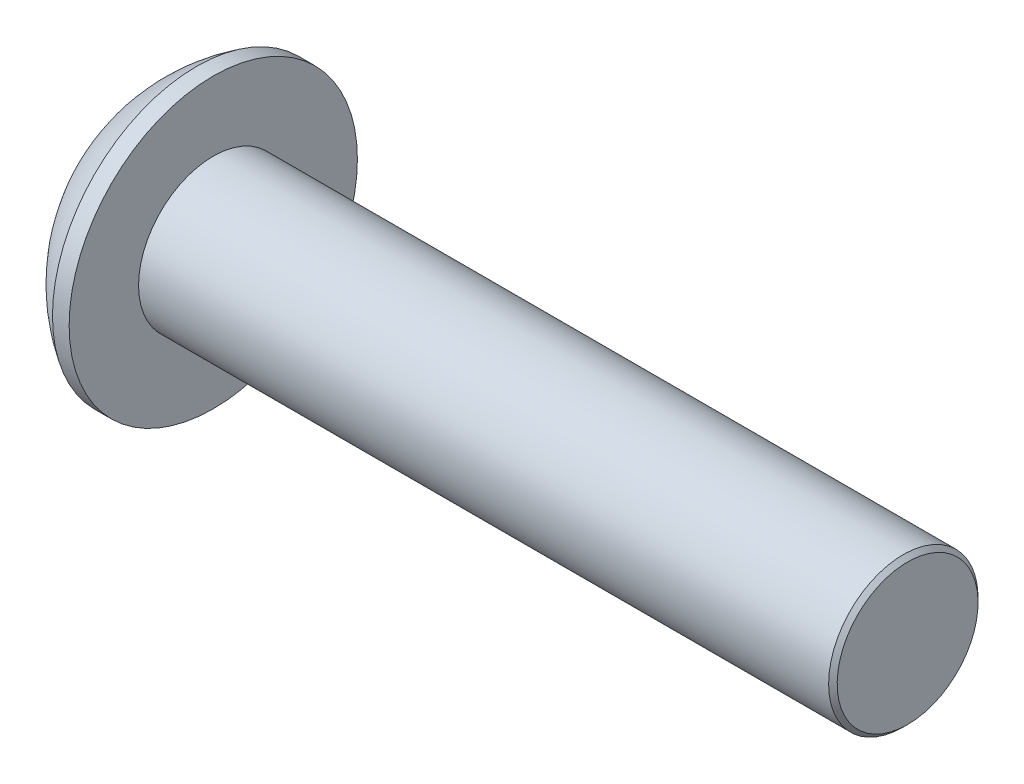
ISO-10303-21;
HEADER;
FILE_DESCRIPTION(('STEP AP214'),'2;1');
FILE_NAME('part.step','',(''),(''),'','','');
FILE_SCHEMA(('AUTOMOTIVE_DESIGN { 1 0 10303 214 1 1 1 1 }'));
ENDSEC;
DATA;
#1=APPLICATION_CONTEXT('core data for automotive mechanical design processes');
#2=APPLICATION_PROTOCOL_DEFINITION('international standard','automotive_design',2000,#1);
#3=PRODUCT_CONTEXT('',#1,'mechanical');
#4=PRODUCT('Part','Part','',(#3));
#5=PRODUCT_RELATED_PRODUCT_CATEGORY('part','',(#4));
#6=PRODUCT_DEFINITION_FORMATION('','',#4);
#7=PRODUCT_DEFINITION_CONTEXT('part definition',#1,'design');
#8=PRODUCT_DEFINITION('design','',#6,#7);
#9=PRODUCT_DEFINITION_SHAPE('','',#8);
#10=(LENGTH_UNIT() NAMED_UNIT(*) SI_UNIT(.MILLI.,.METRE.));
#11=(NAMED_UNIT(*) PLANE_ANGLE_UNIT() SI_UNIT($,.RADIAN.));
#12=(NAMED_UNIT(*) SI_UNIT($,.STERADIAN.) SOLID_ANGLE_UNIT());
#13=UNCERTAINTY_MEASURE_WITH_UNIT(LENGTH_MEASURE(1.E-05),#10,'distance_accuracy_value','');
#14=(GEOMETRIC_REPRESENTATION_CONTEXT(3) GLOBAL_UNCERTAINTY_ASSIGNED_CONTEXT((#13)) GLOBAL_UNIT_ASSIGNED_CONTEXT((#10,
#11,#12)) REPRESENTATION_CONTEXT('',''));
#15=CARTESIAN_POINT('',(0.,0.,0.));
#16=DIRECTION('',(0.,0.,1.));
#17=DIRECTION('',(1.,0.,0.));
#18=AXIS2_PLACEMENT_3D('',#15,#16,#17);
#19=CARTESIAN_POINT('',(1.32080207114083,0.,0.));
#20=DIRECTION('',(-1.,0.,0.));
#21=DIRECTION('',(0.,0.,1.));
#22=AXIS2_PLACEMENT_3D('',#19,#20,#21);
#23=CONICAL_SURFACE('',#22,1.19380119577328,1.0471975499995);
#24=CARTESIAN_POINT('',(2.01004351478429,0.,-4.44089209850063E-13));
#25=VERTEX_POINT('',#24);
#26=VERTEX_LOOP('',#25);
#27=FACE_BOUND('',#26,.T.);
#28=CARTESIAN_POINT('',(1.3208,0.,0.));
#29=DIRECTION('',(1.,0.,0.));
#30=DIRECTION('',(0.,0.,-1.));
#31=AXIS2_PLACEMENT_3D('',#28,#29,#30);
#32=CIRCLE('',#31,1.19380478309441);
#33=CARTESIAN_POINT('',(1.3208,1.0338631981785,0.596901195773596));
#34=VERTEX_POINT('',#33);
#35=CARTESIAN_POINT('',(1.3208,1.0338631981785,-0.5969011957736));
#36=VERTEX_POINT('',#35);
#37=EDGE_CURVE('E166',#34,#36,#32,.F.);
#38=ORIENTED_EDGE('',*,*,#37,.T.);
#39=CARTESIAN_POINT('',(1.3208,0.,0.));
#40=DIRECTION('',(1.,0.,0.));
#41=DIRECTION('',(0.,0.,-1.));
#42=AXIS2_PLACEMENT_3D('',#39,#40,#41);
#43=CIRCLE('',#42,1.19380478309441);
#44=CARTESIAN_POINT('',(1.3208,0.,-1.19380239154721));
#45=VERTEX_POINT('',#44);
#46=EDGE_CURVE('E168',#36,#45,#43,.F.);
#47=ORIENTED_EDGE('',*,*,#46,.T.);
#48=CARTESIAN_POINT('',(1.3208,0.,0.));
#49=DIRECTION('',(1.,0.,0.));
#50=DIRECTION('',(0.,0.,-1.));
#51=AXIS2_PLACEMENT_3D('',#48,#49,#50);
#52=CIRCLE('',#51,1.19380478309441);
#53=CARTESIAN_POINT('',(1.3208,-1.0338631981785,-0.596901195773596));
#54=VERTEX_POINT('',#53);
#55=EDGE_CURVE('E113',#45,#54,#52,.F.);
#56=ORIENTED_EDGE('',*,*,#55,.T.);
#57=CARTESIAN_POINT('',(1.3208,0.,0.));
#58=DIRECTION('',(1.,0.,0.));
#59=DIRECTION('',(0.,0.,-1.));
#60=AXIS2_PLACEMENT_3D('',#57,#58,#59);
#61=CIRCLE('',#60,1.19380478309441);
#62=CARTESIAN_POINT('',(1.3208,-1.0338631981785,0.5969011957736));
#63=VERTEX_POINT('',#62);
#64=EDGE_CURVE('E108',#54,#63,#61,.F.);
#65=ORIENTED_EDGE('',*,*,#64,.T.);
#66=CARTESIAN_POINT('',(1.3208,0.,0.));
#67=DIRECTION('',(1.,0.,0.));
#68=DIRECTION('',(0.,0.,-1.));
#69=AXIS2_PLACEMENT_3D('',#66,#67,#68);
#70=CIRCLE('',#69,1.19380478309441);
#71=CARTESIAN_POINT('',(1.3208,0.,1.19380239154721));
#72=VERTEX_POINT('',#71);
#73=EDGE_CURVE('E110',#63,#72,#70,.F.);
#74=ORIENTED_EDGE('',*,*,#73,.T.);
#75=CARTESIAN_POINT('',(1.3208,0.,0.));
#76=DIRECTION('',(1.,0.,0.));
#77=DIRECTION('',(0.,0.,-1.));
#78=AXIS2_PLACEMENT_3D('',#75,#76,#77);
#79=CIRCLE('',#78,1.19380478309441);
#80=EDGE_CURVE('E164',#72,#34,#79,.F.);
#81=ORIENTED_EDGE('',*,*,#80,.T.);
#82=EDGE_LOOP('',(#38,#47,#56,#65,#74,#81));
#83=FACE_BOUND('',#82,.T.);
#84=ADVANCED_FACE('F37',(#27,#83),#23,.F.);
#85=CARTESIAN_POINT('',(1.3208,-2.06772225407572,-1.1938));
#86=DIRECTION('',(1.,0.,0.));
#87=DIRECTION('',(0.,0.,-1.));
#88=AXIS2_PLACEMENT_3D('',#85,#86,#87);
#89=PLANE('',#88);
#90=DIRECTION('',(0.,0.5,0.866025403784439));
#91=VECTOR('',#90,1.);
#92=CARTESIAN_POINT('',(1.3208,-1.37848150271716,0.));
#93=LINE('',#92,#91);
#94=CARTESIAN_POINT('',(1.3208,-0.689240751358574,1.1938));
#95=VERTEX_POINT('',#94);
#96=EDGE_CURVE('E122',#95,#63,#93,.F.);
#97=ORIENTED_EDGE('',*,*,#96,.F.);
#98=DIRECTION('',(0.,1.,0.));
#99=VECTOR('',#98,1.);
#100=CARTESIAN_POINT('',(1.3208,-0.689240751358565,1.1938));
#101=LINE('',#100,#99);
#102=EDGE_CURVE('E124',#72,#95,#101,.F.);
#103=ORIENTED_EDGE('',*,*,#102,.F.);
#104=ORIENTED_EDGE('',*,*,#73,.F.);
#105=EDGE_LOOP('',(#97,#103,#104));
#106=FACE_BOUND('',#105,.T.);
#107=ADVANCED_FACE('F120',(#106),#89,.F.);
#108=CARTESIAN_POINT('',(1.3208,-2.06772225407572,-1.1938));
#109=DIRECTION('',(1.,0.,0.));
#110=DIRECTION('',(0.,0.,-1.));
#111=AXIS2_PLACEMENT_3D('',#108,#109,#110);
#112=PLANE('',#111);
#113=DIRECTION('',(0.,-0.5,0.866025403784439));
#114=VECTOR('',#113,1.);
#115=CARTESIAN_POINT('',(1.3208,-0.689240751358565,-1.1938));
#116=LINE('',#115,#114);
#117=CARTESIAN_POINT('',(1.3208,-1.37848150271715,0.));
#118=VERTEX_POINT('',#117);
#119=EDGE_CURVE('E131',#118,#54,#116,.F.);
#120=ORIENTED_EDGE('',*,*,#119,.F.);
#121=DIRECTION('',(0.,0.5,0.866025403784439));
#122=VECTOR('',#121,1.);
#123=CARTESIAN_POINT('',(1.3208,-1.37848150271716,0.));
#124=LINE('',#123,#122);
#125=EDGE_CURVE('E128',#63,#118,#124,.F.);
#126=ORIENTED_EDGE('',*,*,#125,.F.);
#127=ORIENTED_EDGE('',*,*,#64,.F.);
#128=EDGE_LOOP('',(#120,#126,#127));
#129=FACE_BOUND('',#128,.T.);
#130=ADVANCED_FACE('F129',(#129),#112,.F.);
#131=CARTESIAN_POINT('',(1.3208,-2.06772225407572,-1.1938));
#132=DIRECTION('',(1.,0.,0.));
#133=DIRECTION('',(0.,0.,-1.));
#134=AXIS2_PLACEMENT_3D('',#131,#132,#133);
#135=PLANE('',#134);
#136=DIRECTION('',(0.,1.,0.));
#137=VECTOR('',#136,1.);
#138=CARTESIAN_POINT('',(1.3208,0.689240751358565,-1.1938));
#139=LINE('',#138,#137);
#140=CARTESIAN_POINT('',(1.3208,-0.689240751358565,-1.1938));
#141=VERTEX_POINT('',#140);
#142=EDGE_CURVE('E261',#141,#45,#139,.T.);
#143=ORIENTED_EDGE('',*,*,#142,.F.);
#144=DIRECTION('',(0.,-0.5,0.866025403784439));
#145=VECTOR('',#144,1.);
#146=CARTESIAN_POINT('',(1.3208,-0.689240751358565,-1.1938));
#147=LINE('',#146,#145);
#148=EDGE_CURVE('E273',#54,#141,#147,.F.);
#149=ORIENTED_EDGE('',*,*,#148,.F.);
#150=ORIENTED_EDGE('',*,*,#55,.F.);
#151=EDGE_LOOP('',(#143,#149,#150));
#152=FACE_BOUND('',#151,.T.);
#153=ADVANCED_FACE('F312',(#152),#135,.F.);
#154=CARTESIAN_POINT('',(1.3208,-2.06772225407572,-1.1938));
#155=DIRECTION('',(1.,0.,0.));
#156=DIRECTION('',(0.,0.,-1.));
#157=AXIS2_PLACEMENT_3D('',#154,#155,#156);
#158=PLANE('',#157);
#159=DIRECTION('',(0.,-0.5,-0.866025403784439));
#160=VECTOR('',#159,1.);
#161=CARTESIAN_POINT('',(1.3208,1.37848150271716,0.));
#162=LINE('',#161,#160);
#163=CARTESIAN_POINT('',(1.3208,0.689240751358574,-1.1938));
#164=VERTEX_POINT('',#163);
#165=EDGE_CURVE('E247',#164,#36,#162,.F.);
#166=ORIENTED_EDGE('',*,*,#165,.F.);
#167=DIRECTION('',(0.,1.,0.));
#168=VECTOR('',#167,1.);
#169=CARTESIAN_POINT('',(1.3208,0.689240751358565,-1.1938));
#170=LINE('',#169,#168);
#171=EDGE_CURVE('E258',#45,#164,#170,.T.);
#172=ORIENTED_EDGE('',*,*,#171,.F.);
#173=ORIENTED_EDGE('',*,*,#46,.F.);
#174=EDGE_LOOP('',(#166,#172,#173));
#175=FACE_BOUND('',#174,.T.);
#176=ADVANCED_FACE('F307',(#175),#158,.F.);
#177=CARTESIAN_POINT('',(1.3208,-2.06772225407572,-1.1938));
#178=DIRECTION('',(1.,0.,0.));
#179=DIRECTION('',(0.,0.,-1.));
#180=AXIS2_PLACEMENT_3D('',#177,#178,#179);
#181=PLANE('',#180);
#182=DIRECTION('',(0.,0.5,-0.866025403784439));
#183=VECTOR('',#182,1.);
#184=CARTESIAN_POINT('',(1.3208,0.689240751358565,1.1938));
#185=LINE('',#184,#183);
#186=CARTESIAN_POINT('',(1.3208,1.37848150271715,0.));
#187=VERTEX_POINT('',#186);
#188=EDGE_CURVE('E226',#187,#34,#185,.F.);
#189=ORIENTED_EDGE('',*,*,#188,.F.);
#190=DIRECTION('',(0.,-0.5,-0.866025403784439));
#191=VECTOR('',#190,1.);
#192=CARTESIAN_POINT('',(1.3208,1.37848150271716,0.));
#193=LINE('',#192,#191);
#194=EDGE_CURVE('E245',#36,#187,#193,.F.);
#195=ORIENTED_EDGE('',*,*,#194,.F.);
#196=ORIENTED_EDGE('',*,*,#37,.F.);
#197=EDGE_LOOP('',(#189,#195,#196));
#198=FACE_BOUND('',#197,.T.);
#199=ADVANCED_FACE('F303',(#198),#181,.F.);
#200=CARTESIAN_POINT('',(1.3208,-2.06772225407572,-1.1938));
#201=DIRECTION('',(1.,0.,0.));
#202=DIRECTION('',(0.,0.,-1.));
#203=AXIS2_PLACEMENT_3D('',#200,#201,#202);
#204=PLANE('',#203);
#205=DIRECTION('',(0.,1.,0.));
#206=VECTOR('',#205,1.);
#207=CARTESIAN_POINT('',(1.3208,-0.689240751358565,1.1938));
#208=LINE('',#207,#206);
#209=CARTESIAN_POINT('',(1.3208,0.689240751358565,1.1938));
#210=VERTEX_POINT('',#209);
#211=EDGE_CURVE('E140',#210,#72,#208,.F.);
#212=ORIENTED_EDGE('',*,*,#211,.F.);
#213=DIRECTION('',(0.,0.5,-0.866025403784439));
#214=VECTOR('',#213,1.);
#215=CARTESIAN_POINT('',(1.3208,0.689240751358565,1.1938));
#216=LINE('',#215,#214);
#217=EDGE_CURVE('E229',#34,#210,#216,.F.);
#218=ORIENTED_EDGE('',*,*,#217,.F.);
#219=ORIENTED_EDGE('',*,*,#80,.F.);
#220=EDGE_LOOP('',(#212,#218,#219));
#221=FACE_BOUND('',#220,.T.);
#222=ADVANCED_FACE('F298',(#221),#204,.F.);
#223=CARTESIAN_POINT('',(1.3208,-0.689240751358565,1.1938));
#224=DIRECTION('',(0.,0.,-1.));
#225=DIRECTION('',(-1.,0.,0.));
#226=AXIS2_PLACEMENT_3D('',#223,#224,#225);
#227=PLANE('',#226);
#228=DIRECTION('',(0.,1.,0.));
#229=VECTOR('',#228,1.);
#230=CARTESIAN_POINT('',(0.,0.,1.1938));
#231=LINE('',#230,#229);
#232=CARTESIAN_POINT('',(0.,0.689240751358565,1.1938));
#233=VERTEX_POINT('',#232);
#234=CARTESIAN_POINT('',(0.,-0.689240751358568,1.1938));
#235=VERTEX_POINT('',#234);
#236=EDGE_CURVE('E223',#233,#235,#231,.F.);
#237=ORIENTED_EDGE('',*,*,#236,.F.);
#238=DIRECTION('',(1.,0.,0.));
#239=VECTOR('',#238,1.);
#240=CARTESIAN_POINT('',(1.3208,0.689240751358565,1.1938));
#241=LINE('',#240,#239);
#242=EDGE_CURVE('E235',#210,#233,#241,.F.);
#243=ORIENTED_EDGE('',*,*,#242,.F.);
#244=ORIENTED_EDGE('',*,*,#211,.T.);
#245=ORIENTED_EDGE('',*,*,#102,.T.);
#246=DIRECTION('',(1.,0.,0.));
#247=VECTOR('',#246,1.);
#248=CARTESIAN_POINT('',(1.3208,-0.689240751358576,1.19380000000001));
#249=LINE('',#248,#247);
#250=EDGE_CURVE('E134',#235,#95,#249,.T.);
#251=ORIENTED_EDGE('',*,*,#250,.F.);
#252=EDGE_LOOP('',(#237,#243,#244,#245,#251));
#253=FACE_BOUND('',#252,.T.);
#254=ADVANCED_FACE('F293',(#253),#227,.T.);
#255=CARTESIAN_POINT('',(1.3208,-1.37848150271716,0.));
#256=DIRECTION('',(0.,0.866025403784439,-0.5));
#257=DIRECTION('',(0.,0.5,0.866025403784439));
#258=AXIS2_PLACEMENT_3D('',#255,#256,#257);
#259=PLANE('',#258);
#260=DIRECTION('',(0.,-0.500000000000008,-0.866025403784434));
#261=VECTOR('',#260,1.);
#262=CARTESIAN_POINT('',(0.,-0.689240751358565,1.1938));
#263=LINE('',#262,#261);
#264=CARTESIAN_POINT('',(0.,-1.37848150271715,0.));
#265=VERTEX_POINT('',#264);
#266=EDGE_CURVE('E220',#235,#265,#263,.T.);
#267=ORIENTED_EDGE('',*,*,#266,.F.);
#268=ORIENTED_EDGE('',*,*,#250,.T.);
#269=ORIENTED_EDGE('',*,*,#96,.T.);
#270=ORIENTED_EDGE('',*,*,#125,.T.);
#271=DIRECTION('',(1.,0.,0.));
#272=VECTOR('',#271,1.);
#273=CARTESIAN_POINT('',(1.3208,-1.37848150271714,0.));
#274=LINE('',#273,#272);
#275=EDGE_CURVE('E270',#265,#118,#274,.T.);
#276=ORIENTED_EDGE('',*,*,#275,.F.);
#277=EDGE_LOOP('',(#267,#268,#269,#270,#276));
#278=FACE_BOUND('',#277,.T.);
#279=ADVANCED_FACE('F138',(#278),#259,.T.);
#280=CARTESIAN_POINT('',(1.3208,-0.689240751358565,-1.1938));
#281=DIRECTION('',(0.,0.866025403784439,0.5));
#282=DIRECTION('',(0.,-0.5,0.866025403784439));
#283=AXIS2_PLACEMENT_3D('',#280,#281,#282);
#284=PLANE('',#283);
#285=DIRECTION('',(0.,0.500000000000008,-0.866025403784434));
#286=VECTOR('',#285,1.);
#287=CARTESIAN_POINT('',(0.,-1.37848150271716,0.));
#288=LINE('',#287,#286);
#289=CARTESIAN_POINT('',(0.,-0.689240751358565,-1.1938));
#290=VERTEX_POINT('',#289);
#291=EDGE_CURVE('E217',#265,#290,#288,.T.);
#292=ORIENTED_EDGE('',*,*,#291,.F.);
#293=ORIENTED_EDGE('',*,*,#275,.T.);
#294=ORIENTED_EDGE('',*,*,#119,.T.);
#295=ORIENTED_EDGE('',*,*,#148,.T.);
#296=DIRECTION('',(1.,0.,0.));
#297=VECTOR('',#296,1.);
#298=CARTESIAN_POINT('',(1.3208,-0.689240751358565,-1.1938));
#299=LINE('',#298,#297);
#300=EDGE_CURVE('E255',#290,#141,#299,.T.);
#301=ORIENTED_EDGE('',*,*,#300,.F.);
#302=EDGE_LOOP('',(#292,#293,#294,#295,#301));
#303=FACE_BOUND('',#302,.T.);
#304=ADVANCED_FACE('F288',(#303),#284,.T.);
#305=CARTESIAN_POINT('',(1.3208,0.689240751358565,-1.1938));
#306=DIRECTION('',(0.,0.,1.));
#307=DIRECTION('',(1.,0.,0.));
#308=AXIS2_PLACEMENT_3D('',#305,#306,#307);
#309=PLANE('',#308);
#310=DIRECTION('',(0.,1.,0.));
#311=VECTOR('',#310,1.);
#312=CARTESIAN_POINT('',(0.,0.,-1.1938));
#313=LINE('',#312,#311);
#314=CARTESIAN_POINT('',(0.,0.689240751358568,-1.1938));
#315=VERTEX_POINT('',#314);
#316=EDGE_CURVE('E214',#290,#315,#313,.T.);
#317=ORIENTED_EDGE('',*,*,#316,.F.);
#318=ORIENTED_EDGE('',*,*,#300,.T.);
#319=ORIENTED_EDGE('',*,*,#142,.T.);
#320=ORIENTED_EDGE('',*,*,#171,.T.);
#321=DIRECTION('',(1.,0.,0.));
#322=VECTOR('',#321,1.);
#323=CARTESIAN_POINT('',(1.3208,0.689240751358576,-1.19380000000001));
#324=LINE('',#323,#322);
#325=EDGE_CURVE('E230',#315,#164,#324,.T.);
#326=ORIENTED_EDGE('',*,*,#325,.F.);
#327=EDGE_LOOP('',(#317,#318,#319,#320,#326));
#328=FACE_BOUND('',#327,.T.);
#329=ADVANCED_FACE('F310',(#328),#309,.T.);
#330=CARTESIAN_POINT('',(1.3208,1.37848150271716,0.));
#331=DIRECTION('',(0.,-0.866025403784439,0.5));
#332=DIRECTION('',(0.,-0.5,-0.866025403784439));
#333=AXIS2_PLACEMENT_3D('',#330,#331,#332);
#334=PLANE('',#333);
#335=DIRECTION('',(0.,0.500000000000008,0.866025403784434));
#336=VECTOR('',#335,1.);
#337=CARTESIAN_POINT('',(0.,0.689240751358565,-1.1938));
#338=LINE('',#337,#336);
#339=CARTESIAN_POINT('',(0.,1.37848150271715,0.));
#340=VERTEX_POINT('',#339);
#341=EDGE_CURVE('E211',#315,#340,#338,.T.);
#342=ORIENTED_EDGE('',*,*,#341,.F.);
#343=ORIENTED_EDGE('',*,*,#325,.T.);
#344=ORIENTED_EDGE('',*,*,#165,.T.);
#345=ORIENTED_EDGE('',*,*,#194,.T.);
#346=DIRECTION('',(1.,0.,0.));
#347=VECTOR('',#346,1.);
#348=CARTESIAN_POINT('',(1.3208,1.37848150271714,0.));
#349=LINE('',#348,#347);
#350=EDGE_CURVE('E54',#340,#187,#349,.T.);
#351=ORIENTED_EDGE('',*,*,#350,.F.);
#352=EDGE_LOOP('',(#342,#343,#344,#345,#351));
#353=FACE_BOUND('',#352,.T.);
#354=ADVANCED_FACE('F304',(#353),#334,.T.);
#355=CARTESIAN_POINT('',(1.3208,0.689240751358565,1.1938));
#356=DIRECTION('',(0.,-0.866025403784439,-0.5));
#357=DIRECTION('',(0.,0.5,-0.866025403784439));
#358=AXIS2_PLACEMENT_3D('',#355,#356,#357);
#359=PLANE('',#358);
#360=DIRECTION('',(0.,-0.500000000000008,0.866025403784434));
#361=VECTOR('',#360,1.);
#362=CARTESIAN_POINT('',(0.,1.37848150271716,0.));
#363=LINE('',#362,#361);
#364=EDGE_CURVE('E163',#340,#233,#363,.T.);
#365=ORIENTED_EDGE('',*,*,#364,.F.);
#366=ORIENTED_EDGE('',*,*,#350,.T.);
#367=ORIENTED_EDGE('',*,*,#188,.T.);
#368=ORIENTED_EDGE('',*,*,#217,.T.);
#369=ORIENTED_EDGE('',*,*,#242,.T.);
#370=EDGE_LOOP('',(#365,#366,#367,#368,#369));
#371=FACE_BOUND('',#370,.T.);
#372=ADVANCED_FACE('F295',(#371),#359,.T.);
#373=CARTESIAN_POINT('',(0.,0.,0.));
#374=DIRECTION('',(-1.,0.,0.));
#375=DIRECTION('',(0.,0.,1.));
#376=AXIS2_PLACEMENT_3D('',#373,#374,#375);
#377=PLANE('',#376);
#378=ORIENTED_EDGE('',*,*,#341,.T.);
#379=ORIENTED_EDGE('',*,*,#364,.T.);
#380=ORIENTED_EDGE('',*,*,#236,.T.);
#381=ORIENTED_EDGE('',*,*,#266,.T.);
#382=ORIENTED_EDGE('',*,*,#291,.T.);
#383=ORIENTED_EDGE('',*,*,#316,.T.);
#384=EDGE_LOOP('',(#378,#379,#380,#381,#382,#383));
#385=FACE_BOUND('',#384,.T.);
#386=CARTESIAN_POINT('',(0.,0.,0.));
#387=DIRECTION('',(1.,0.,0.));
#388=DIRECTION('',(0.,0.,-1.));
#389=AXIS2_PLACEMENT_3D('',#386,#387,#388);
#390=CIRCLE('',#389,1.64782500000001);
#391=CARTESIAN_POINT('',(0.,0.,-1.64782500000001));
#392=VERTEX_POINT('',#391);
#393=EDGE_CURVE('E160',#392,#392,#390,.T.);
#394=ORIENTED_EDGE('',*,*,#393,.F.);
#395=EDGE_LOOP('',(#394));
#396=FACE_BOUND('',#395,.T.);
#397=ADVANCED_FACE('F201',(#385,#396),#377,.T.);
#398=CARTESIAN_POINT('',(3.50132362607758,0.,0.));
#399=DIRECTION('',(1.,0.,0.));
#400=DIRECTION('',(0.,1.,0.));
#401=AXIS2_PLACEMENT_3D('',#398,#399,#400);
#402=SPHERICAL_SURFACE('',#401,3.86970210289553);
#403=CARTESIAN_POINT('',(1.4732,0.,0.));
#404=DIRECTION('',(-1.,0.,0.));
#405=DIRECTION('',(0.,0.,1.));
#406=AXIS2_PLACEMENT_3D('',#403,#404,#405);
#407=CIRCLE('',#406,3.29565);
#408=CARTESIAN_POINT('',(1.4732,0.,3.29565));
#409=VERTEX_POINT('',#408);
#410=EDGE_CURVE('E159',#409,#409,#407,.F.);
#411=ORIENTED_EDGE('',*,*,#410,.F.);
#412=EDGE_LOOP('',(#411));
#413=FACE_BOUND('',#412,.T.);
#414=ORIENTED_EDGE('',*,*,#393,.T.);
#415=EDGE_LOOP('',(#414));
#416=FACE_BOUND('',#415,.T.);
#417=ADVANCED_FACE('F185',(#413,#416),#402,.T.);
#418=CARTESIAN_POINT('',(0.,0.,0.));
#419=DIRECTION('',(-1.,0.,0.));
#420=DIRECTION('',(0.,0.,1.));
#421=AXIS2_PLACEMENT_3D('',#418,#419,#420);
#422=CYLINDRICAL_SURFACE('',#421,3.29565);
#423=ORIENTED_EDGE('',*,*,#410,.T.);
#424=EDGE_LOOP('',(#423));
#425=FACE_BOUND('',#424,.T.);
#426=CARTESIAN_POINT('',(1.8542,0.,0.));
#427=DIRECTION('',(-1.,0.,0.));
#428=DIRECTION('',(0.,0.,1.));
#429=AXIS2_PLACEMENT_3D('',#426,#427,#428);
#430=CIRCLE('',#429,3.29565);
#431=CARTESIAN_POINT('',(1.8542,0.,3.29565));
#432=VERTEX_POINT('',#431);
#433=EDGE_CURVE('E156',#432,#432,#430,.T.);
#434=ORIENTED_EDGE('',*,*,#433,.T.);
#435=EDGE_LOOP('',(#434));
#436=FACE_BOUND('',#435,.T.);
#437=ADVANCED_FACE('F178',(#425,#436),#422,.T.);
#438=CARTESIAN_POINT('',(17.7292,0.,0.));
#439=DIRECTION('',(-1.,0.,0.));
#440=DIRECTION('',(0.,0.,1.));
#441=AXIS2_PLACEMENT_3D('',#438,#439,#440);
#442=PLANE('',#441);
#443=CARTESIAN_POINT('',(17.72920002135,0.,0.));
#444=DIRECTION('',(-1.,0.,0.));
#445=DIRECTION('',(0.,-1.,0.));
#446=AXIS2_PLACEMENT_3D('',#443,#444,#445);
#447=CIRCLE('',#446,1.61036002134998);
#448=CARTESIAN_POINT('',(17.72920002135,-1.61036002134998,0.));
#449=VERTEX_POINT('',#448);
#450=EDGE_CURVE('E155',#449,#449,#447,.T.);
#451=ORIENTED_EDGE('',*,*,#450,.F.);
#452=EDGE_LOOP('',(#451));
#453=FACE_BOUND('',#452,.T.);
#454=ADVANCED_FACE('F175',(#453),#442,.F.);
#455=CARTESIAN_POINT('',(1.8542,1.70815,0.));
#456=DIRECTION('',(-1.,0.,0.));
#457=DIRECTION('',(0.,0.,1.));
#458=AXIS2_PLACEMENT_3D('',#455,#456,#457);
#459=PLANE('',#458);
#460=CARTESIAN_POINT('',(1.8542,0.,0.));
#461=DIRECTION('',(-1.,0.,0.));
#462=DIRECTION('',(0.,0.,1.));
#463=AXIS2_PLACEMENT_3D('',#460,#461,#462);
#464=CIRCLE('',#463,1.70815);
#465=CARTESIAN_POINT('',(1.8542,0.,1.70815));
#466=VERTEX_POINT('',#465);
#467=EDGE_CURVE('E46',#466,#466,#464,.F.);
#468=ORIENTED_EDGE('',*,*,#467,.F.);
#469=EDGE_LOOP('',(#468));
#470=FACE_BOUND('',#469,.T.);
#471=ORIENTED_EDGE('',*,*,#433,.F.);
#472=EDGE_LOOP('',(#471));
#473=FACE_BOUND('',#472,.T.);
#474=ADVANCED_FACE('F177',(#470,#473),#459,.F.);
#475=CARTESIAN_POINT('',(17.6314100212622,0.,0.));
#476=DIRECTION('',(-1.,0.,0.));
#477=DIRECTION('',(0.,-1.,0.));
#478=AXIS2_PLACEMENT_3D('',#475,#476,#477);
#479=CONICAL_SURFACE('',#478,1.7081500212622,0.785398162499983);
#480=ORIENTED_EDGE('',*,*,#450,.T.);
#481=EDGE_LOOP('',(#480));
#482=FACE_BOUND('',#481,.T.);
#483=CARTESIAN_POINT('',(17.63141,0.,0.));
#484=DIRECTION('',(-1.,0.,0.));
#485=DIRECTION('',(0.,0.,1.));
#486=AXIS2_PLACEMENT_3D('',#483,#484,#485);
#487=CIRCLE('',#486,1.70815);
#488=CARTESIAN_POINT('',(17.63141,0.,1.70815));
#489=VERTEX_POINT('',#488);
#490=EDGE_CURVE('E12',#489,#489,#487,.T.);
#491=ORIENTED_EDGE('',*,*,#490,.F.);
#492=EDGE_LOOP('',(#491));
#493=FACE_BOUND('',#492,.T.);
#494=ADVANCED_FACE('F39',(#482,#493),#479,.T.);
#495=CARTESIAN_POINT('',(0.,0.,0.));
#496=DIRECTION('',(-1.,0.,0.));
#497=DIRECTION('',(0.,0.,1.));
#498=AXIS2_PLACEMENT_3D('',#495,#496,#497);
#499=CYLINDRICAL_SURFACE('',#498,1.70815);
#500=ORIENTED_EDGE('',*,*,#490,.T.);
#501=EDGE_LOOP('',(#500));
#502=FACE_BOUND('',#501,.T.);
#503=ORIENTED_EDGE('',*,*,#467,.T.);
#504=EDGE_LOOP('',(#503));
#505=FACE_BOUND('',#504,.T.);
#506=ADVANCED_FACE('F189',(#502,#505),#499,.T.);
#507=CLOSED_SHELL('',(#84,#107,#130,#153,#176,#199,#222,#254,#279,#304,#329,#354,#372,#397,#417,
#437,#454,#474,#494,#506));
#508=MANIFOLD_SOLID_BREP('B2',#507);
#509=ADVANCED_BREP_SHAPE_REPRESENTATION('',(#18,#508),#14);
#510=SHAPE_DEFINITION_REPRESENTATION(#9,#509);
ENDSEC;
END-ISO-10303-21;
